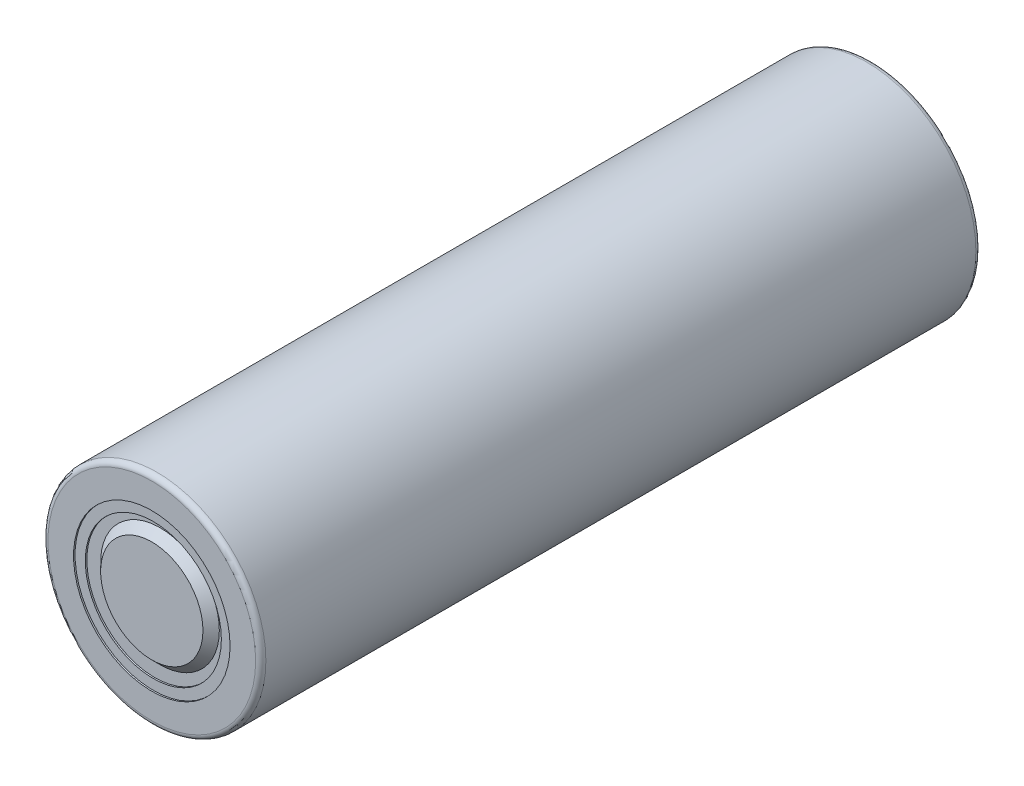
ISO-10303-21;
HEADER;
FILE_DESCRIPTION(('STEP AP214'),'2;1');
FILE_NAME('part.step','',(''),(''),'','','');
FILE_SCHEMA(('AUTOMOTIVE_DESIGN { 1 0 10303 214 1 1 1 1 }'));
ENDSEC;
DATA;
#1=APPLICATION_CONTEXT('core data for automotive mechanical design processes');
#2=APPLICATION_PROTOCOL_DEFINITION('international standard','automotive_design',2000,#1);
#3=PRODUCT_CONTEXT('',#1,'mechanical');
#4=PRODUCT('Part','Part','',(#3));
#5=PRODUCT_RELATED_PRODUCT_CATEGORY('part','',(#4));
#6=PRODUCT_DEFINITION_FORMATION('','',#4);
#7=PRODUCT_DEFINITION_CONTEXT('part definition',#1,'design');
#8=PRODUCT_DEFINITION('design','',#6,#7);
#9=PRODUCT_DEFINITION_SHAPE('','',#8);
#10=(LENGTH_UNIT() NAMED_UNIT(*) SI_UNIT(.MILLI.,.METRE.));
#11=(NAMED_UNIT(*) PLANE_ANGLE_UNIT() SI_UNIT($,.RADIAN.));
#12=(NAMED_UNIT(*) SI_UNIT($,.STERADIAN.) SOLID_ANGLE_UNIT());
#13=UNCERTAINTY_MEASURE_WITH_UNIT(LENGTH_MEASURE(1.E-05),#10,'distance_accuracy_value','');
#14=(GEOMETRIC_REPRESENTATION_CONTEXT(3) GLOBAL_UNCERTAINTY_ASSIGNED_CONTEXT((#13)) GLOBAL_UNIT_ASSIGNED_CONTEXT((#10,
#11,#12)) REPRESENTATION_CONTEXT('',''));
#15=CARTESIAN_POINT('',(0.,0.,0.));
#16=DIRECTION('',(0.,0.,1.));
#17=DIRECTION('',(1.,0.,0.));
#18=AXIS2_PLACEMENT_3D('',#15,#16,#17);
#19=CARTESIAN_POINT('',(0.,0.,70.4));
#20=DIRECTION('',(0.,0.,-1.));
#21=DIRECTION('',(-1.,0.,0.));
#22=AXIS2_PLACEMENT_3D('',#19,#20,#21);
#23=CYLINDRICAL_SURFACE('',#22,10.65);
#24=CARTESIAN_POINT('',(0.,0.,0.5));
#25=DIRECTION('',(0.,0.,1.));
#26=DIRECTION('',(1.,0.,0.));
#27=AXIS2_PLACEMENT_3D('',#24,#25,#26);
#28=CIRCLE('',#27,10.65);
#29=CARTESIAN_POINT('',(10.65,0.,0.5));
#30=VERTEX_POINT('',#29);
#31=EDGE_CURVE('E44',#30,#30,#28,.T.);
#32=ORIENTED_EDGE('',*,*,#31,.T.);
#33=EDGE_LOOP('',(#32));
#34=FACE_BOUND('',#33,.T.);
#35=CARTESIAN_POINT('',(0.,0.,69.9));
#36=DIRECTION('',(0.,0.,1.));
#37=DIRECTION('',(1.,0.,0.));
#38=AXIS2_PLACEMENT_3D('',#35,#36,#37);
#39=CIRCLE('',#38,10.65);
#40=CARTESIAN_POINT('',(10.65,0.,69.9));
#41=VERTEX_POINT('',#40);
#42=EDGE_CURVE('E48',#41,#41,#39,.F.);
#43=ORIENTED_EDGE('',*,*,#42,.T.);
#44=EDGE_LOOP('',(#43));
#45=FACE_BOUND('',#44,.T.);
#46=ADVANCED_FACE('F33',(#34,#45),#23,.T.);
#47=CARTESIAN_POINT('',(0.,0.,70.4));
#48=DIRECTION('',(0.,0.,1.));
#49=DIRECTION('',(1.,0.,0.));
#50=AXIS2_PLACEMENT_3D('',#47,#48,#49);
#51=PLANE('',#50);
#52=CARTESIAN_POINT('',(0.,0.,70.4));
#53=DIRECTION('',(0.,0.,1.));
#54=DIRECTION('',(1.,0.,0.));
#55=AXIS2_PLACEMENT_3D('',#52,#53,#54);
#56=CIRCLE('',#55,10.15);
#57=CARTESIAN_POINT('',(10.15,0.,70.4));
#58=VERTEX_POINT('',#57);
#59=EDGE_CURVE('E10',#58,#58,#56,.T.);
#60=ORIENTED_EDGE('',*,*,#59,.T.);
#61=EDGE_LOOP('',(#60));
#62=FACE_BOUND('',#61,.T.);
#63=CARTESIAN_POINT('',(0.,0.,70.4));
#64=DIRECTION('',(0.,0.,1.));
#65=DIRECTION('',(1.,0.,0.));
#66=AXIS2_PLACEMENT_3D('',#63,#64,#65);
#67=CIRCLE('',#66,7.65000000199067);
#68=CARTESIAN_POINT('',(7.65000000199067,0.,70.4));
#69=VERTEX_POINT('',#68);
#70=EDGE_CURVE('E71',#69,#69,#67,.T.);
#71=ORIENTED_EDGE('',*,*,#70,.F.);
#72=EDGE_LOOP('',(#71));
#73=FACE_BOUND('',#72,.T.);
#74=ADVANCED_FACE('F100',(#62,#73),#51,.T.);
#75=CARTESIAN_POINT('',(0.,0.,0.));
#76=DIRECTION('',(0.,0.,1.));
#77=DIRECTION('',(1.,0.,0.));
#78=AXIS2_PLACEMENT_3D('',#75,#76,#77);
#79=PLANE('',#78);
#80=CARTESIAN_POINT('',(0.,0.,0.));
#81=DIRECTION('',(0.,0.,1.));
#82=DIRECTION('',(1.,0.,0.));
#83=AXIS2_PLACEMENT_3D('',#80,#81,#82);
#84=CIRCLE('',#83,10.15);
#85=CARTESIAN_POINT('',(10.15,0.,0.));
#86=VERTEX_POINT('',#85);
#87=EDGE_CURVE('E40',#86,#86,#84,.F.);
#88=ORIENTED_EDGE('',*,*,#87,.T.);
#89=EDGE_LOOP('',(#88));
#90=FACE_BOUND('',#89,.T.);
#91=CARTESIAN_POINT('',(0.,0.,0.));
#92=DIRECTION('',(0.,0.,1.));
#93=DIRECTION('',(1.,0.,0.));
#94=AXIS2_PLACEMENT_3D('',#91,#92,#93);
#95=CIRCLE('',#94,8.65);
#96=CARTESIAN_POINT('',(8.65,0.,0.));
#97=VERTEX_POINT('',#96);
#98=EDGE_CURVE('E54',#97,#97,#95,.T.);
#99=ORIENTED_EDGE('',*,*,#98,.T.);
#100=EDGE_LOOP('',(#99));
#101=FACE_BOUND('',#100,.T.);
#102=ADVANCED_FACE('F110',(#90,#101),#79,.F.);
#103=CARTESIAN_POINT('',(0.,0.,0.2));
#104=DIRECTION('',(0.,0.,-1.));
#105=DIRECTION('',(-1.,0.,0.));
#106=AXIS2_PLACEMENT_3D('',#103,#104,#105);
#107=CYLINDRICAL_SURFACE('',#106,8.65);
#108=CARTESIAN_POINT('',(0.,0.,0.2));
#109=DIRECTION('',(0.,0.,1.));
#110=DIRECTION('',(1.,0.,0.));
#111=AXIS2_PLACEMENT_3D('',#108,#109,#110);
#112=CIRCLE('',#111,8.65);
#113=CARTESIAN_POINT('',(8.65,0.,0.2));
#114=VERTEX_POINT('',#113);
#115=EDGE_CURVE('E53',#114,#114,#112,.T.);
#116=ORIENTED_EDGE('',*,*,#115,.T.);
#117=EDGE_LOOP('',(#116));
#118=FACE_BOUND('',#117,.T.);
#119=ORIENTED_EDGE('',*,*,#98,.F.);
#120=EDGE_LOOP('',(#119));
#121=FACE_BOUND('',#120,.T.);
#122=ADVANCED_FACE('F139',(#118,#121),#107,.F.);
#123=CARTESIAN_POINT('',(0.,0.,0.2));
#124=DIRECTION('',(0.,0.,1.));
#125=DIRECTION('',(1.,0.,0.));
#126=AXIS2_PLACEMENT_3D('',#123,#124,#125);
#127=PLANE('',#126);
#128=ORIENTED_EDGE('',*,*,#115,.F.);
#129=EDGE_LOOP('',(#128));
#130=FACE_BOUND('',#129,.T.);
#131=ADVANCED_FACE('F218',(#130),#127,.F.);
#132=CARTESIAN_POINT('',(-6.64999999942362,0.,70.1));
#133=DIRECTION('',(0.,0.,-1.));
#134=DIRECTION('',(-1.,0.,0.));
#135=AXIS2_PLACEMENT_3D('',#132,#133,#134);
#136=PLANE('',#135);
#137=CARTESIAN_POINT('',(0.,0.,70.1));
#138=DIRECTION('',(0.,0.,1.));
#139=DIRECTION('',(1.,0.,0.));
#140=AXIS2_PLACEMENT_3D('',#137,#138,#139);
#141=CIRCLE('',#140,6.64999999942362);
#142=CARTESIAN_POINT('',(6.64999999942362,0.,70.1));
#143=VERTEX_POINT('',#142);
#144=EDGE_CURVE('E80',#143,#143,#141,.T.);
#145=ORIENTED_EDGE('',*,*,#144,.T.);
#146=EDGE_LOOP('',(#145));
#147=FACE_BOUND('',#146,.T.);
#148=CARTESIAN_POINT('',(0.,0.,70.1));
#149=DIRECTION('',(0.,0.,1.));
#150=DIRECTION('',(1.,0.,0.));
#151=AXIS2_PLACEMENT_3D('',#148,#149,#150);
#152=CIRCLE('',#151,9.14999999931387);
#153=CARTESIAN_POINT('',(9.14999999931387,0.,70.1));
#154=VERTEX_POINT('',#153);
#155=EDGE_CURVE('E57',#154,#154,#152,.T.);
#156=ORIENTED_EDGE('',*,*,#155,.F.);
#157=EDGE_LOOP('',(#156));
#158=FACE_BOUND('',#157,.T.);
#159=ADVANCED_FACE('F84',(#147,#158),#136,.T.);
#160=CARTESIAN_POINT('',(0.,0.,70.4));
#161=DIRECTION('',(0.,0.,1.));
#162=DIRECTION('',(1.,0.,0.));
#163=AXIS2_PLACEMENT_3D('',#160,#161,#162);
#164=CYLINDRICAL_SURFACE('',#163,9.14999999931387);
#165=ORIENTED_EDGE('',*,*,#155,.T.);
#166=EDGE_LOOP('',(#165));
#167=FACE_BOUND('',#166,.T.);
#168=CARTESIAN_POINT('',(0.,0.,69.6000000006565));
#169=DIRECTION('',(0.,0.,1.));
#170=DIRECTION('',(1.,0.,0.));
#171=AXIS2_PLACEMENT_3D('',#168,#169,#170);
#172=CIRCLE('',#171,9.14999999931387);
#173=CARTESIAN_POINT('',(9.14999999931387,0.,69.6000000006565));
#174=VERTEX_POINT('',#173);
#175=EDGE_CURVE('E62',#174,#174,#172,.T.);
#176=ORIENTED_EDGE('',*,*,#175,.F.);
#177=EDGE_LOOP('',(#176));
#178=FACE_BOUND('',#177,.T.);
#179=ADVANCED_FACE('F200',(#167,#178),#164,.F.);
#180=CARTESIAN_POINT('',(-9.14999999931387,0.,69.6000000006565));
#181=DIRECTION('',(0.,0.,1.));
#182=DIRECTION('',(1.,0.,0.));
#183=AXIS2_PLACEMENT_3D('',#180,#181,#182);
#184=PLANE('',#183);
#185=ORIENTED_EDGE('',*,*,#175,.T.);
#186=EDGE_LOOP('',(#185));
#187=FACE_BOUND('',#186,.T.);
#188=CARTESIAN_POINT('',(0.,0.,69.6000000006565));
#189=DIRECTION('',(0.,0.,1.));
#190=DIRECTION('',(1.,0.,0.));
#191=AXIS2_PLACEMENT_3D('',#188,#189,#190);
#192=CIRCLE('',#191,5.79999999934352);
#193=CARTESIAN_POINT('',(5.79999999934352,0.,69.6000000006565));
#194=VERTEX_POINT('',#193);
#195=EDGE_CURVE('E65',#194,#194,#192,.T.);
#196=ORIENTED_EDGE('',*,*,#195,.F.);
#197=EDGE_LOOP('',(#196));
#198=FACE_BOUND('',#197,.T.);
#199=ADVANCED_FACE('F190',(#187,#198),#184,.T.);
#200=CARTESIAN_POINT('',(0.,0.,70.4));
#201=DIRECTION('',(0.,0.,-1.));
#202=DIRECTION('',(-1.,0.,0.));
#203=AXIS2_PLACEMENT_3D('',#200,#201,#202);
#204=CONICAL_SURFACE('',#203,5.,0.785398163397448);
#205=ORIENTED_EDGE('',*,*,#195,.T.);
#206=EDGE_LOOP('',(#205));
#207=FACE_BOUND('',#206,.T.);
#208=CARTESIAN_POINT('',(0.,0.,70.4));
#209=DIRECTION('',(0.,0.,1.));
#210=DIRECTION('',(1.,0.,0.));
#211=AXIS2_PLACEMENT_3D('',#208,#209,#210);
#212=CIRCLE('',#211,5.);
#213=CARTESIAN_POINT('',(5.,0.,70.4));
#214=VERTEX_POINT('',#213);
#215=EDGE_CURVE('E68',#214,#214,#212,.T.);
#216=ORIENTED_EDGE('',*,*,#215,.F.);
#217=EDGE_LOOP('',(#216));
#218=FACE_BOUND('',#217,.T.);
#219=ADVANCED_FACE('F180',(#207,#218),#204,.T.);
#220=CARTESIAN_POINT('',(0.,0.,70.4));
#221=DIRECTION('',(0.,0.,1.));
#222=DIRECTION('',(1.,0.,0.));
#223=AXIS2_PLACEMENT_3D('',#220,#221,#222);
#224=CYLINDRICAL_SURFACE('',#223,7.65000000199067);
#225=ORIENTED_EDGE('',*,*,#70,.T.);
#226=EDGE_LOOP('',(#225));
#227=FACE_BOUND('',#226,.T.);
#228=CARTESIAN_POINT('',(0.,0.,70.25));
#229=DIRECTION('',(0.,0.,1.));
#230=DIRECTION('',(1.,0.,0.));
#231=AXIS2_PLACEMENT_3D('',#228,#229,#230);
#232=CIRCLE('',#231,7.65000000199067);
#233=CARTESIAN_POINT('',(7.65000000199067,0.,70.25));
#234=VERTEX_POINT('',#233);
#235=EDGE_CURVE('E74',#234,#234,#232,.T.);
#236=ORIENTED_EDGE('',*,*,#235,.F.);
#237=EDGE_LOOP('',(#236));
#238=FACE_BOUND('',#237,.T.);
#239=ADVANCED_FACE('F101',(#227,#238),#224,.F.);
#240=CARTESIAN_POINT('',(-7.65000000199067,0.,70.25));
#241=DIRECTION('',(0.,0.,1.));
#242=DIRECTION('',(1.,0.,0.));
#243=AXIS2_PLACEMENT_3D('',#240,#241,#242);
#244=PLANE('',#243);
#245=ORIENTED_EDGE('',*,*,#235,.T.);
#246=EDGE_LOOP('',(#245));
#247=FACE_BOUND('',#246,.T.);
#248=CARTESIAN_POINT('',(0.,0.,70.25));
#249=DIRECTION('',(0.,0.,1.));
#250=DIRECTION('',(1.,0.,0.));
#251=AXIS2_PLACEMENT_3D('',#248,#249,#250);
#252=CIRCLE('',#251,6.64999999942362);
#253=CARTESIAN_POINT('',(6.64999999942362,0.,70.25));
#254=VERTEX_POINT('',#253);
#255=EDGE_CURVE('E77',#254,#254,#252,.T.);
#256=ORIENTED_EDGE('',*,*,#255,.F.);
#257=EDGE_LOOP('',(#256));
#258=FACE_BOUND('',#257,.T.);
#259=ADVANCED_FACE('F90',(#247,#258),#244,.T.);
#260=CARTESIAN_POINT('',(0.,0.,70.4));
#261=DIRECTION('',(0.,0.,1.));
#262=DIRECTION('',(1.,0.,0.));
#263=AXIS2_PLACEMENT_3D('',#260,#261,#262);
#264=CYLINDRICAL_SURFACE('',#263,6.64999999942362);
#265=ORIENTED_EDGE('',*,*,#255,.T.);
#266=EDGE_LOOP('',(#265));
#267=FACE_BOUND('',#266,.T.);
#268=ORIENTED_EDGE('',*,*,#144,.F.);
#269=EDGE_LOOP('',(#268));
#270=FACE_BOUND('',#269,.T.);
#271=ADVANCED_FACE('F87',(#267,#270),#264,.F.);
#272=ORIENTED_EDGE('',*,*,#215,.T.);
#273=EDGE_LOOP('',(#272));
#274=FACE_BOUND('',#273,.T.);
#275=ADVANCED_FACE('F89',(#274),#51,.T.);
#276=CARTESIAN_POINT('',(0.,0.,0.5));
#277=DIRECTION('',(0.,0.,1.));
#278=DIRECTION('',(1.,0.,0.));
#279=AXIS2_PLACEMENT_3D('',#276,#277,#278);
#280=TOROIDAL_SURFACE('',#279,10.15,0.5);
#281=ORIENTED_EDGE('',*,*,#87,.F.);
#282=EDGE_LOOP('',(#281));
#283=FACE_BOUND('',#282,.T.);
#284=ORIENTED_EDGE('',*,*,#31,.F.);
#285=EDGE_LOOP('',(#284));
#286=FACE_BOUND('',#285,.T.);
#287=ADVANCED_FACE('F97',(#283,#286),#280,.T.);
#288=CARTESIAN_POINT('',(0.,0.,69.9));
#289=DIRECTION('',(0.,0.,1.));
#290=DIRECTION('',(1.,0.,0.));
#291=AXIS2_PLACEMENT_3D('',#288,#289,#290);
#292=TOROIDAL_SURFACE('',#291,10.15,0.5);
#293=ORIENTED_EDGE('',*,*,#42,.F.);
#294=EDGE_LOOP('',(#293));
#295=FACE_BOUND('',#294,.T.);
#296=ORIENTED_EDGE('',*,*,#59,.F.);
#297=EDGE_LOOP('',(#296));
#298=FACE_BOUND('',#297,.T.);
#299=ADVANCED_FACE('F35',(#295,#298),#292,.T.);
#300=CLOSED_SHELL('',(#46,#74,#102,#122,#131,#159,#179,#199,#219,#239,#259,#271,#275,#287,#299));
#301=MANIFOLD_SOLID_BREP('B2',#300);
#302=ADVANCED_BREP_SHAPE_REPRESENTATION('',(#18,#301),#14);
#303=SHAPE_DEFINITION_REPRESENTATION(#9,#302);
ENDSEC;
END-ISO-10303-21;
